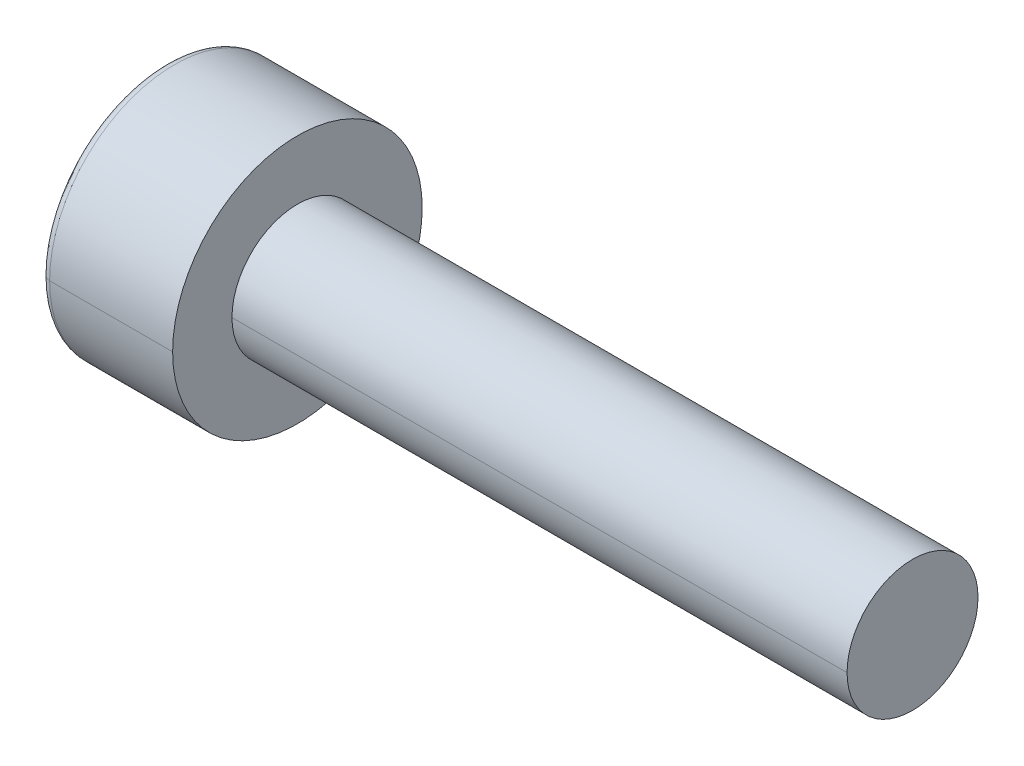
ISO-10303-21;
HEADER;
FILE_DESCRIPTION(('STEP AP214'),'2;1');
FILE_NAME('part.step','',(''),(''),'','','');
FILE_SCHEMA(('AUTOMOTIVE_DESIGN { 1 0 10303 214 1 1 1 1 }'));
ENDSEC;
DATA;
#1=APPLICATION_CONTEXT('core data for automotive mechanical design processes');
#2=APPLICATION_PROTOCOL_DEFINITION('international standard','automotive_design',2000,#1);
#3=PRODUCT_CONTEXT('',#1,'mechanical');
#4=PRODUCT('Part','Part','',(#3));
#5=PRODUCT_RELATED_PRODUCT_CATEGORY('part','',(#4));
#6=PRODUCT_DEFINITION_FORMATION('','',#4);
#7=PRODUCT_DEFINITION_CONTEXT('part definition',#1,'design');
#8=PRODUCT_DEFINITION('design','',#6,#7);
#9=PRODUCT_DEFINITION_SHAPE('','',#8);
#10=(LENGTH_UNIT() NAMED_UNIT(*) SI_UNIT(.MILLI.,.METRE.));
#11=(NAMED_UNIT(*) PLANE_ANGLE_UNIT() SI_UNIT($,.RADIAN.));
#12=(NAMED_UNIT(*) SI_UNIT($,.STERADIAN.) SOLID_ANGLE_UNIT());
#13=UNCERTAINTY_MEASURE_WITH_UNIT(LENGTH_MEASURE(1.E-05),#10,'distance_accuracy_value','');
#14=(GEOMETRIC_REPRESENTATION_CONTEXT(3) GLOBAL_UNCERTAINTY_ASSIGNED_CONTEXT((#13)) GLOBAL_UNIT_ASSIGNED_CONTEXT((#10,
#11,#12)) REPRESENTATION_CONTEXT('',''));
#15=CARTESIAN_POINT('',(0.,0.,0.));
#16=DIRECTION('',(0.,0.,1.));
#17=DIRECTION('',(1.,0.,0.));
#18=AXIS2_PLACEMENT_3D('',#15,#16,#17);
#19=CARTESIAN_POINT('',(0.2,0.,0.));
#20=DIRECTION('',(1.,0.,0.));
#21=DIRECTION('',(0.,0.,-1.));
#22=AXIS2_PLACEMENT_3D('',#19,#20,#21);
#23=TOROIDAL_SURFACE('',#22,2.64,0.2);
#24=CARTESIAN_POINT('',(0.2,0.,2.64));
#25=DIRECTION('',(0.,1.,0.));
#26=DIRECTION('',(0.,0.,1.));
#27=AXIS2_PLACEMENT_3D('',#24,#25,#26);
#28=CIRCLE('',#27,0.2);
#29=CARTESIAN_POINT('',(0.,0.,2.64));
#30=VERTEX_POINT('',#29);
#31=CARTESIAN_POINT('',(0.2,0.,2.84));
#32=VERTEX_POINT('',#31);
#33=EDGE_CURVE('E522',#30,#32,#28,.T.);
#34=ORIENTED_EDGE('',*,*,#33,.F.);
#35=CARTESIAN_POINT('',(0.,0.,0.));
#36=DIRECTION('',(-1.,0.,0.));
#37=DIRECTION('',(0.,0.,-1.));
#38=AXIS2_PLACEMENT_3D('',#35,#36,#37);
#39=CIRCLE('',#38,2.64);
#40=CARTESIAN_POINT('',(0.,0.,-2.64));
#41=VERTEX_POINT('',#40);
#42=EDGE_CURVE('E190',#41,#30,#39,.T.);
#43=ORIENTED_EDGE('',*,*,#42,.F.);
#44=CARTESIAN_POINT('',(0.2,0.,-2.64));
#45=DIRECTION('',(0.,-1.,0.));
#46=DIRECTION('',(0.,0.,-1.));
#47=AXIS2_PLACEMENT_3D('',#44,#45,#46);
#48=CIRCLE('',#47,0.2);
#49=CARTESIAN_POINT('',(0.2,0.,-2.84));
#50=VERTEX_POINT('',#49);
#51=EDGE_CURVE('E163',#41,#50,#48,.T.);
#52=ORIENTED_EDGE('',*,*,#51,.T.);
#53=CARTESIAN_POINT('',(0.2,0.,0.));
#54=DIRECTION('',(1.,0.,0.));
#55=DIRECTION('',(0.,0.,-1.));
#56=AXIS2_PLACEMENT_3D('',#53,#54,#55);
#57=CIRCLE('',#56,2.84);
#58=EDGE_CURVE('E196',#32,#50,#57,.T.);
#59=ORIENTED_EDGE('',*,*,#58,.F.);
#60=EDGE_LOOP('',(#34,#43,#52,#59));
#61=FACE_BOUND('',#60,.T.);
#62=ADVANCED_FACE('F16',(#61),#23,.T.);
#63=CARTESIAN_POINT('',(1.3,0.,0.));
#64=DIRECTION('',(-1.,0.,0.));
#65=DIRECTION('',(0.,0.,1.));
#66=AXIS2_PLACEMENT_3D('',#63,#64,#65);
#67=PLANE('',#66);
#68=DIRECTION('',(0.,-0.866025403784439,-0.5));
#69=VECTOR('',#68,1.);
#70=CARTESIAN_POINT('',(1.3,1.25,-0.721687836487032));
#71=LINE('',#70,#69);
#72=CARTESIAN_POINT('',(1.3,1.25,-0.721687836487032));
#73=VERTEX_POINT('',#72);
#74=CARTESIAN_POINT('',(1.3,0.,-1.44337567297406));
#75=VERTEX_POINT('',#74);
#76=EDGE_CURVE('E206',#73,#75,#71,.T.);
#77=ORIENTED_EDGE('',*,*,#76,.T.);
#78=DIRECTION('',(0.,-0.866025403784439,0.5));
#79=VECTOR('',#78,1.);
#80=CARTESIAN_POINT('',(1.3,0.,-1.44337567297406));
#81=LINE('',#80,#79);
#82=CARTESIAN_POINT('',(1.3,-1.25,-0.721687836487033));
#83=VERTEX_POINT('',#82);
#84=EDGE_CURVE('E10',#75,#83,#81,.T.);
#85=ORIENTED_EDGE('',*,*,#84,.T.);
#86=DIRECTION('',(0.,0.,1.));
#87=VECTOR('',#86,1.);
#88=CARTESIAN_POINT('',(1.3,-1.25,-0.721687836487033));
#89=LINE('',#88,#87);
#90=CARTESIAN_POINT('',(1.3,-1.25,0.721687836487032));
#91=VERTEX_POINT('',#90);
#92=EDGE_CURVE('E43',#83,#91,#89,.T.);
#93=ORIENTED_EDGE('',*,*,#92,.T.);
#94=DIRECTION('',(0.,0.866025403784439,0.5));
#95=VECTOR('',#94,1.);
#96=CARTESIAN_POINT('',(1.3,-1.25,0.721687836487032));
#97=LINE('',#96,#95);
#98=CARTESIAN_POINT('',(1.3,0.,1.44337567297406));
#99=VERTEX_POINT('',#98);
#100=EDGE_CURVE('E134',#91,#99,#97,.T.);
#101=ORIENTED_EDGE('',*,*,#100,.T.);
#102=DIRECTION('',(0.,0.866025403784439,-0.5));
#103=VECTOR('',#102,1.);
#104=CARTESIAN_POINT('',(1.3,0.,1.44337567297406));
#105=LINE('',#104,#103);
#106=CARTESIAN_POINT('',(1.3,1.25,0.721687836487033));
#107=VERTEX_POINT('',#106);
#108=EDGE_CURVE('E216',#99,#107,#105,.T.);
#109=ORIENTED_EDGE('',*,*,#108,.T.);
#110=DIRECTION('',(0.,0.,-1.));
#111=VECTOR('',#110,1.);
#112=CARTESIAN_POINT('',(1.3,1.25,0.721687836487033));
#113=LINE('',#112,#111);
#114=EDGE_CURVE('E210',#107,#73,#113,.T.);
#115=ORIENTED_EDGE('',*,*,#114,.T.);
#116=EDGE_LOOP('',(#77,#85,#93,#101,#109,#115));
#117=FACE_BOUND('',#116,.T.);
#118=ADVANCED_FACE('F332',(#117),#67,.T.);
#119=CARTESIAN_POINT('',(1.3,0.,-1.44337567297406));
#120=DIRECTION('',(0.,-0.5,-0.866025403784439));
#121=DIRECTION('',(0.,-0.866025403784439,0.5));
#122=AXIS2_PLACEMENT_3D('',#119,#120,#121);
#123=PLANE('',#122);
#124=DIRECTION('',(0.,-0.866025403784439,0.5));
#125=VECTOR('',#124,1.);
#126=CARTESIAN_POINT('',(0.,0.,-1.44337567297406));
#127=LINE('',#126,#125);
#128=CARTESIAN_POINT('',(0.,0.,-1.44337567297406));
#129=VERTEX_POINT('',#128);
#130=CARTESIAN_POINT('',(0.,-1.25,-0.721687836487033));
#131=VERTEX_POINT('',#130);
#132=EDGE_CURVE('E191',#129,#131,#127,.T.);
#133=ORIENTED_EDGE('',*,*,#132,.T.);
#134=DIRECTION('',(-1.,0.,0.));
#135=VECTOR('',#134,1.);
#136=CARTESIAN_POINT('',(1.3,-1.25,-0.721687836487033));
#137=LINE('',#136,#135);
#138=EDGE_CURVE('E24',#83,#131,#137,.T.);
#139=ORIENTED_EDGE('',*,*,#138,.F.);
#140=ORIENTED_EDGE('',*,*,#84,.F.);
#141=DIRECTION('',(-1.,0.,0.));
#142=VECTOR('',#141,1.);
#143=CARTESIAN_POINT('',(1.3,0.,-1.44337567297406));
#144=LINE('',#143,#142);
#145=EDGE_CURVE('E203',#75,#129,#144,.T.);
#146=ORIENTED_EDGE('',*,*,#145,.T.);
#147=EDGE_LOOP('',(#133,#139,#140,#146));
#148=FACE_BOUND('',#147,.T.);
#149=ADVANCED_FACE('F337',(#148),#123,.F.);
#150=CARTESIAN_POINT('',(1.3,-1.25,-0.721687836487033));
#151=DIRECTION('',(0.,-1.,0.));
#152=DIRECTION('',(-1.,0.,0.));
#153=AXIS2_PLACEMENT_3D('',#150,#151,#152);
#154=PLANE('',#153);
#155=DIRECTION('',(0.,0.,1.));
#156=VECTOR('',#155,1.);
#157=CARTESIAN_POINT('',(0.,-1.25,-0.721687836487033));
#158=LINE('',#157,#156);
#159=CARTESIAN_POINT('',(0.,-1.25,0.721687836487032));
#160=VERTEX_POINT('',#159);
#161=EDGE_CURVE('E139',#131,#160,#158,.T.);
#162=ORIENTED_EDGE('',*,*,#161,.T.);
#163=DIRECTION('',(-1.,0.,0.));
#164=VECTOR('',#163,1.);
#165=CARTESIAN_POINT('',(1.3,-1.25,0.721687836487032));
#166=LINE('',#165,#164);
#167=EDGE_CURVE('E127',#91,#160,#166,.T.);
#168=ORIENTED_EDGE('',*,*,#167,.F.);
#169=ORIENTED_EDGE('',*,*,#92,.F.);
#170=ORIENTED_EDGE('',*,*,#138,.T.);
#171=EDGE_LOOP('',(#162,#168,#169,#170));
#172=FACE_BOUND('',#171,.T.);
#173=ADVANCED_FACE('F140',(#172),#154,.F.);
#174=CARTESIAN_POINT('',(1.3,-1.25,0.721687836487032));
#175=DIRECTION('',(0.,-0.5,0.866025403784439));
#176=DIRECTION('',(-1.,0.,0.));
#177=AXIS2_PLACEMENT_3D('',#174,#175,#176);
#178=PLANE('',#177);
#179=DIRECTION('',(0.,0.866025403784439,0.5));
#180=VECTOR('',#179,1.);
#181=CARTESIAN_POINT('',(0.,-1.25,0.721687836487032));
#182=LINE('',#181,#180);
#183=CARTESIAN_POINT('',(0.,0.,1.44337567297406));
#184=VERTEX_POINT('',#183);
#185=EDGE_CURVE('E132',#160,#184,#182,.T.);
#186=ORIENTED_EDGE('',*,*,#185,.T.);
#187=DIRECTION('',(-1.,0.,0.));
#188=VECTOR('',#187,1.);
#189=CARTESIAN_POINT('',(1.3,0.,1.44337567297406));
#190=LINE('',#189,#188);
#191=EDGE_CURVE('E219',#99,#184,#190,.T.);
#192=ORIENTED_EDGE('',*,*,#191,.F.);
#193=ORIENTED_EDGE('',*,*,#100,.F.);
#194=ORIENTED_EDGE('',*,*,#167,.T.);
#195=EDGE_LOOP('',(#186,#192,#193,#194));
#196=FACE_BOUND('',#195,.T.);
#197=ADVANCED_FACE('F129',(#196),#178,.F.);
#198=CARTESIAN_POINT('',(1.3,0.,1.44337567297406));
#199=DIRECTION('',(0.,0.5,0.866025403784439));
#200=DIRECTION('',(1.,0.,0.));
#201=AXIS2_PLACEMENT_3D('',#198,#199,#200);
#202=PLANE('',#201);
#203=DIRECTION('',(0.,0.866025403784439,-0.5));
#204=VECTOR('',#203,1.);
#205=CARTESIAN_POINT('',(0.,0.,1.44337567297406));
#206=LINE('',#205,#204);
#207=CARTESIAN_POINT('',(0.,1.25,0.721687836487033));
#208=VERTEX_POINT('',#207);
#209=EDGE_CURVE('E151',#184,#208,#206,.T.);
#210=ORIENTED_EDGE('',*,*,#209,.T.);
#211=DIRECTION('',(-1.,0.,0.));
#212=VECTOR('',#211,1.);
#213=CARTESIAN_POINT('',(1.3,1.25,0.721687836487033));
#214=LINE('',#213,#212);
#215=EDGE_CURVE('E213',#107,#208,#214,.T.);
#216=ORIENTED_EDGE('',*,*,#215,.F.);
#217=ORIENTED_EDGE('',*,*,#108,.F.);
#218=ORIENTED_EDGE('',*,*,#191,.T.);
#219=EDGE_LOOP('',(#210,#216,#217,#218));
#220=FACE_BOUND('',#219,.T.);
#221=ADVANCED_FACE('F294',(#220),#202,.F.);
#222=CARTESIAN_POINT('',(1.3,1.25,0.721687836487033));
#223=DIRECTION('',(0.,1.,0.));
#224=DIRECTION('',(1.,0.,0.));
#225=AXIS2_PLACEMENT_3D('',#222,#223,#224);
#226=PLANE('',#225);
#227=DIRECTION('',(0.,0.,-1.));
#228=VECTOR('',#227,1.);
#229=CARTESIAN_POINT('',(0.,1.25,0.721687836487033));
#230=LINE('',#229,#228);
#231=CARTESIAN_POINT('',(0.,1.25,-0.721687836487032));
#232=VERTEX_POINT('',#231);
#233=EDGE_CURVE('E159',#208,#232,#230,.T.);
#234=ORIENTED_EDGE('',*,*,#233,.T.);
#235=DIRECTION('',(-1.,0.,0.));
#236=VECTOR('',#235,1.);
#237=CARTESIAN_POINT('',(1.3,1.25,-0.721687836487032));
#238=LINE('',#237,#236);
#239=EDGE_CURVE('E207',#73,#232,#238,.T.);
#240=ORIENTED_EDGE('',*,*,#239,.F.);
#241=ORIENTED_EDGE('',*,*,#114,.F.);
#242=ORIENTED_EDGE('',*,*,#215,.T.);
#243=EDGE_LOOP('',(#234,#240,#241,#242));
#244=FACE_BOUND('',#243,.T.);
#245=ADVANCED_FACE('F299',(#244),#226,.F.);
#246=CARTESIAN_POINT('',(1.3,1.25,-0.721687836487032));
#247=DIRECTION('',(0.,0.5,-0.866025403784439));
#248=DIRECTION('',(-1.,0.,0.));
#249=AXIS2_PLACEMENT_3D('',#246,#247,#248);
#250=PLANE('',#249);
#251=DIRECTION('',(0.,-0.866025403784439,-0.5));
#252=VECTOR('',#251,1.);
#253=CARTESIAN_POINT('',(0.,1.25,-0.721687836487032));
#254=LINE('',#253,#252);
#255=EDGE_CURVE('E177',#232,#129,#254,.T.);
#256=ORIENTED_EDGE('',*,*,#255,.T.);
#257=ORIENTED_EDGE('',*,*,#145,.F.);
#258=ORIENTED_EDGE('',*,*,#76,.F.);
#259=ORIENTED_EDGE('',*,*,#239,.T.);
#260=EDGE_LOOP('',(#256,#257,#258,#259));
#261=FACE_BOUND('',#260,.T.);
#262=ADVANCED_FACE('F312',(#261),#250,.F.);
#263=CARTESIAN_POINT('',(17.,1.49,0.));
#264=DIRECTION('',(-1.,0.,0.));
#265=DIRECTION('',(0.,0.,1.));
#266=AXIS2_PLACEMENT_3D('',#263,#264,#265);
#267=PLANE('',#266);
#268=CARTESIAN_POINT('',(17.,0.,0.));
#269=DIRECTION('',(-1.,0.,0.));
#270=DIRECTION('',(0.,0.,1.));
#271=AXIS2_PLACEMENT_3D('',#268,#269,#270);
#272=CIRCLE('',#271,1.49);
#273=CARTESIAN_POINT('',(17.,0.,1.49));
#274=VERTEX_POINT('',#273);
#275=CARTESIAN_POINT('',(17.,0.,-1.49));
#276=VERTEX_POINT('',#275);
#277=EDGE_CURVE('E169',#274,#276,#272,.T.);
#278=ORIENTED_EDGE('',*,*,#277,.F.);
#279=CARTESIAN_POINT('',(17.,0.,0.));
#280=DIRECTION('',(-1.,0.,0.));
#281=DIRECTION('',(0.,0.,1.));
#282=AXIS2_PLACEMENT_3D('',#279,#280,#281);
#283=CIRCLE('',#282,1.49);
#284=EDGE_CURVE('E200',#276,#274,#283,.T.);
#285=ORIENTED_EDGE('',*,*,#284,.F.);
#286=EDGE_LOOP('',(#278,#285));
#287=FACE_BOUND('',#286,.T.);
#288=ADVANCED_FACE('F245',(#287),#267,.F.);
#289=CARTESIAN_POINT('',(0.,0.,0.));
#290=DIRECTION('',(-1.,0.,0.));
#291=DIRECTION('',(0.,0.,1.));
#292=AXIS2_PLACEMENT_3D('',#289,#290,#291);
#293=CYLINDRICAL_SURFACE('',#292,1.49);
#294=DIRECTION('',(-1.,0.,0.));
#295=VECTOR('',#294,1.);
#296=CARTESIAN_POINT('',(0.,0.,-1.49));
#297=LINE('',#296,#295);
#298=CARTESIAN_POINT('',(3.,0.,-1.49));
#299=VERTEX_POINT('',#298);
#300=EDGE_CURVE('E165',#276,#299,#297,.T.);
#301=ORIENTED_EDGE('',*,*,#300,.F.);
#302=ORIENTED_EDGE('',*,*,#284,.T.);
#303=DIRECTION('',(-1.,0.,0.));
#304=VECTOR('',#303,1.);
#305=CARTESIAN_POINT('',(0.,0.,1.49));
#306=LINE('',#305,#304);
#307=CARTESIAN_POINT('',(3.,0.,1.49));
#308=VERTEX_POINT('',#307);
#309=EDGE_CURVE('E173',#274,#308,#306,.T.);
#310=ORIENTED_EDGE('',*,*,#309,.T.);
#311=CARTESIAN_POINT('',(3.,0.,0.));
#312=DIRECTION('',(-1.,0.,0.));
#313=DIRECTION('',(0.,0.,1.));
#314=AXIS2_PLACEMENT_3D('',#311,#312,#313);
#315=CIRCLE('',#314,1.49);
#316=EDGE_CURVE('E199',#299,#308,#315,.T.);
#317=ORIENTED_EDGE('',*,*,#316,.F.);
#318=EDGE_LOOP('',(#301,#302,#310,#317));
#319=FACE_BOUND('',#318,.T.);
#320=ADVANCED_FACE('F239',(#319),#293,.T.);
#321=CARTESIAN_POINT('',(3.,2.84,0.));
#322=DIRECTION('',(-1.,0.,0.));
#323=DIRECTION('',(0.,0.,1.));
#324=AXIS2_PLACEMENT_3D('',#321,#322,#323);
#325=PLANE('',#324);
#326=CARTESIAN_POINT('',(3.,0.,0.));
#327=DIRECTION('',(-1.,0.,0.));
#328=DIRECTION('',(0.,0.,1.));
#329=AXIS2_PLACEMENT_3D('',#326,#327,#328);
#330=CIRCLE('',#329,1.49);
#331=EDGE_CURVE('E168',#308,#299,#330,.T.);
#332=ORIENTED_EDGE('',*,*,#331,.T.);
#333=ORIENTED_EDGE('',*,*,#316,.T.);
#334=EDGE_LOOP('',(#332,#333));
#335=FACE_BOUND('',#334,.T.);
#336=CARTESIAN_POINT('',(3.,0.,0.));
#337=DIRECTION('',(-1.,0.,0.));
#338=DIRECTION('',(0.,0.,1.));
#339=AXIS2_PLACEMENT_3D('',#336,#337,#338);
#340=CIRCLE('',#339,2.84);
#341=CARTESIAN_POINT('',(3.,0.,2.84));
#342=VERTEX_POINT('',#341);
#343=CARTESIAN_POINT('',(3.,0.,-2.84));
#344=VERTEX_POINT('',#343);
#345=EDGE_CURVE('E180',#342,#344,#340,.T.);
#346=ORIENTED_EDGE('',*,*,#345,.F.);
#347=CARTESIAN_POINT('',(3.,0.,0.));
#348=DIRECTION('',(-1.,0.,0.));
#349=DIRECTION('',(0.,0.,1.));
#350=AXIS2_PLACEMENT_3D('',#347,#348,#349);
#351=CIRCLE('',#350,2.84);
#352=EDGE_CURVE('E145',#344,#342,#351,.T.);
#353=ORIENTED_EDGE('',*,*,#352,.F.);
#354=EDGE_LOOP('',(#346,#353));
#355=FACE_BOUND('',#354,.T.);
#356=ADVANCED_FACE('F244',(#335,#355),#325,.F.);
#357=CARTESIAN_POINT('',(0.,0.,0.));
#358=DIRECTION('',(-1.,0.,0.));
#359=DIRECTION('',(0.,0.,1.));
#360=AXIS2_PLACEMENT_3D('',#357,#358,#359);
#361=CYLINDRICAL_SURFACE('',#360,2.84);
#362=DIRECTION('',(-1.,0.,0.));
#363=VECTOR('',#362,1.);
#364=CARTESIAN_POINT('',(0.,0.,-2.84));
#365=LINE('',#364,#363);
#366=EDGE_CURVE('E185',#344,#50,#365,.T.);
#367=ORIENTED_EDGE('',*,*,#366,.F.);
#368=ORIENTED_EDGE('',*,*,#352,.T.);
#369=DIRECTION('',(-1.,0.,0.));
#370=VECTOR('',#369,1.);
#371=CARTESIAN_POINT('',(0.,0.,2.84));
#372=LINE('',#371,#370);
#373=EDGE_CURVE('E186',#342,#32,#372,.T.);
#374=ORIENTED_EDGE('',*,*,#373,.T.);
#375=ORIENTED_EDGE('',*,*,#58,.T.);
#376=EDGE_LOOP('',(#367,#368,#374,#375));
#377=FACE_BOUND('',#376,.T.);
#378=ADVANCED_FACE('F259',(#377),#361,.T.);
#379=CARTESIAN_POINT('',(0.,0.,0.));
#380=DIRECTION('',(1.,0.,0.));
#381=DIRECTION('',(0.,1.,0.));
#382=AXIS2_PLACEMENT_3D('',#379,#380,#381);
#383=PLANE('',#382);
#384=ORIENTED_EDGE('',*,*,#132,.F.);
#385=ORIENTED_EDGE('',*,*,#255,.F.);
#386=ORIENTED_EDGE('',*,*,#233,.F.);
#387=ORIENTED_EDGE('',*,*,#209,.F.);
#388=ORIENTED_EDGE('',*,*,#185,.F.);
#389=ORIENTED_EDGE('',*,*,#161,.F.);
#390=EDGE_LOOP('',(#384,#385,#386,#387,#388,#389));
#391=FACE_BOUND('',#390,.T.);
#392=ORIENTED_EDGE('',*,*,#42,.T.);
#393=CARTESIAN_POINT('',(0.,0.,0.));
#394=DIRECTION('',(-1.,0.,0.));
#395=DIRECTION('',(0.,0.,-1.));
#396=AXIS2_PLACEMENT_3D('',#393,#394,#395);
#397=CIRCLE('',#396,2.64);
#398=EDGE_CURVE('E529',#30,#41,#397,.T.);
#399=ORIENTED_EDGE('',*,*,#398,.T.);
#400=EDGE_LOOP('',(#392,#399));
#401=FACE_BOUND('',#400,.T.);
#402=ADVANCED_FACE('F147',(#391,#401),#383,.F.);
#403=CARTESIAN_POINT('',(0.,0.,0.));
#404=DIRECTION('',(-1.,0.,0.));
#405=DIRECTION('',(0.,0.,1.));
#406=AXIS2_PLACEMENT_3D('',#403,#404,#405);
#407=CYLINDRICAL_SURFACE('',#406,2.84);
#408=ORIENTED_EDGE('',*,*,#345,.T.);
#409=ORIENTED_EDGE('',*,*,#366,.T.);
#410=CARTESIAN_POINT('',(0.2,0.,0.));
#411=DIRECTION('',(1.,0.,0.));
#412=DIRECTION('',(0.,0.,-1.));
#413=AXIS2_PLACEMENT_3D('',#410,#411,#412);
#414=CIRCLE('',#413,2.84);
#415=EDGE_CURVE('E528',#50,#32,#414,.T.);
#416=ORIENTED_EDGE('',*,*,#415,.T.);
#417=ORIENTED_EDGE('',*,*,#373,.F.);
#418=EDGE_LOOP('',(#408,#409,#416,#417));
#419=FACE_BOUND('',#418,.T.);
#420=ADVANCED_FACE('F285',(#419),#407,.T.);
#421=CARTESIAN_POINT('',(0.,0.,0.));
#422=DIRECTION('',(-1.,0.,0.));
#423=DIRECTION('',(0.,0.,1.));
#424=AXIS2_PLACEMENT_3D('',#421,#422,#423);
#425=CYLINDRICAL_SURFACE('',#424,1.49);
#426=ORIENTED_EDGE('',*,*,#277,.T.);
#427=ORIENTED_EDGE('',*,*,#300,.T.);
#428=ORIENTED_EDGE('',*,*,#331,.F.);
#429=ORIENTED_EDGE('',*,*,#309,.F.);
#430=EDGE_LOOP('',(#426,#427,#428,#429));
#431=FACE_BOUND('',#430,.T.);
#432=ADVANCED_FACE('F273',(#431),#425,.T.);
#433=CARTESIAN_POINT('',(0.2,0.,0.));
#434=DIRECTION('',(1.,0.,0.));
#435=DIRECTION('',(0.,0.,-1.));
#436=AXIS2_PLACEMENT_3D('',#433,#434,#435);
#437=TOROIDAL_SURFACE('',#436,2.64,0.2);
#438=ORIENTED_EDGE('',*,*,#398,.F.);
#439=ORIENTED_EDGE('',*,*,#33,.T.);
#440=ORIENTED_EDGE('',*,*,#415,.F.);
#441=ORIENTED_EDGE('',*,*,#51,.F.);
#442=EDGE_LOOP('',(#438,#439,#440,#441));
#443=FACE_BOUND('',#442,.T.);
#444=ADVANCED_FACE('F268',(#443),#437,.T.);
#445=CLOSED_SHELL('',(#62,#118,#149,#173,#197,#221,#245,#262,#288,#320,#356,#378,#402,#420,#432,#444));
#446=MANIFOLD_SOLID_BREP('B1',#445);
#447=ADVANCED_BREP_SHAPE_REPRESENTATION('',(#18,#446),#14);
#448=SHAPE_DEFINITION_REPRESENTATION(#9,#447);
ENDSEC;
END-ISO-10303-21;
